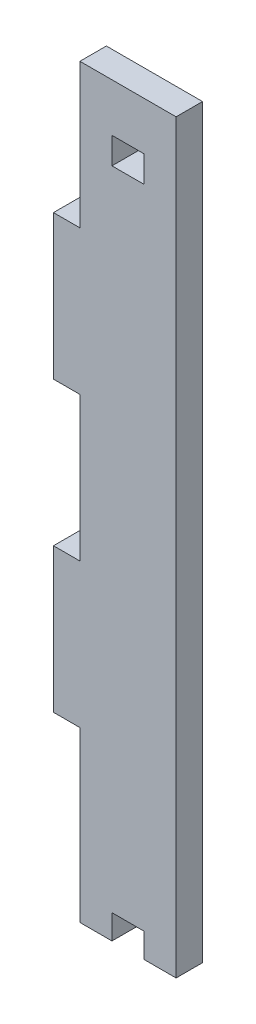
ISO-10303-21;
HEADER;
FILE_DESCRIPTION(('STEP AP214'),'2;1');
FILE_NAME('part.step','',(''),(''),'','','');
FILE_SCHEMA(('AUTOMOTIVE_DESIGN { 1 0 10303 214 1 1 1 1 }'));
ENDSEC;
DATA;
#1=APPLICATION_CONTEXT('core data for automotive mechanical design processes');
#2=APPLICATION_PROTOCOL_DEFINITION('international standard','automotive_design',2000,#1);
#3=PRODUCT_CONTEXT('',#1,'mechanical');
#4=PRODUCT('Part','Part','',(#3));
#5=PRODUCT_RELATED_PRODUCT_CATEGORY('part','',(#4));
#6=PRODUCT_DEFINITION_FORMATION('','',#4);
#7=PRODUCT_DEFINITION_CONTEXT('part definition',#1,'design');
#8=PRODUCT_DEFINITION('design','',#6,#7);
#9=PRODUCT_DEFINITION_SHAPE('','',#8);
#10=(LENGTH_UNIT() NAMED_UNIT(*) SI_UNIT(.MILLI.,.METRE.));
#11=(NAMED_UNIT(*) PLANE_ANGLE_UNIT() SI_UNIT($,.RADIAN.));
#12=(NAMED_UNIT(*) SI_UNIT($,.STERADIAN.) SOLID_ANGLE_UNIT());
#13=UNCERTAINTY_MEASURE_WITH_UNIT(LENGTH_MEASURE(1.E-05),#10,'distance_accuracy_value','');
#14=(GEOMETRIC_REPRESENTATION_CONTEXT(3) GLOBAL_UNCERTAINTY_ASSIGNED_CONTEXT((#13)) GLOBAL_UNIT_ASSIGNED_CONTEXT((#10,
#11,#12)) REPRESENTATION_CONTEXT('',''));
#15=CARTESIAN_POINT('',(0.,0.,0.));
#16=DIRECTION('',(0.,0.,1.));
#17=DIRECTION('',(1.,0.,0.));
#18=AXIS2_PLACEMENT_3D('',#15,#16,#17);
#19=CARTESIAN_POINT('',(0.,0.,5.5));
#20=DIRECTION('',(0.,1.,0.));
#21=DIRECTION('',(0.,0.,1.));
#22=AXIS2_PLACEMENT_3D('',#19,#20,#21);
#23=PLANE('',#22);
#24=DIRECTION('',(1.,0.,0.));
#25=VECTOR('',#24,1.);
#26=CARTESIAN_POINT('',(0.,0.,0.));
#27=LINE('',#26,#25);
#28=CARTESIAN_POINT('',(6.66666666666667,0.,0.));
#29=VERTEX_POINT('',#28);
#30=CARTESIAN_POINT('',(13.3333333333333,0.,0.));
#31=VERTEX_POINT('',#30);
#32=EDGE_CURVE('E53',#29,#31,#27,.T.);
#33=ORIENTED_EDGE('',*,*,#32,.T.);
#34=DIRECTION('',(0.,0.,1.));
#35=VECTOR('',#34,1.);
#36=CARTESIAN_POINT('',(13.3333333333333,0.,-8.39371457963901));
#37=LINE('',#36,#35);
#38=CARTESIAN_POINT('',(13.3333333333333,0.,5.5));
#39=VERTEX_POINT('',#38);
#40=EDGE_CURVE('E48',#31,#39,#37,.T.);
#41=ORIENTED_EDGE('',*,*,#40,.T.);
#42=DIRECTION('',(1.,0.,0.));
#43=VECTOR('',#42,1.);
#44=CARTESIAN_POINT('',(0.,0.,5.5));
#45=LINE('',#44,#43);
#46=CARTESIAN_POINT('',(6.66666666666667,0.,5.5));
#47=VERTEX_POINT('',#46);
#48=EDGE_CURVE('E185',#47,#39,#45,.T.);
#49=ORIENTED_EDGE('',*,*,#48,.F.);
#50=DIRECTION('',(0.,0.,1.));
#51=VECTOR('',#50,1.);
#52=CARTESIAN_POINT('',(6.66666666666667,0.,-8.39371457963901));
#53=LINE('',#52,#51);
#54=EDGE_CURVE('E205',#29,#47,#53,.T.);
#55=ORIENTED_EDGE('',*,*,#54,.F.);
#56=EDGE_LOOP('',(#33,#41,#49,#55));
#57=FACE_BOUND('',#56,.T.);
#58=ADVANCED_FACE('F31',(#57),#23,.F.);
#59=CARTESIAN_POINT('',(0.,0.,5.5));
#60=DIRECTION('',(1.,0.,0.));
#61=DIRECTION('',(0.,0.,-1.));
#62=AXIS2_PLACEMENT_3D('',#59,#60,#61);
#63=PLANE('',#62);
#64=DIRECTION('',(0.,-1.,0.));
#65=VECTOR('',#64,1.);
#66=CARTESIAN_POINT('',(0.,0.,0.));
#67=LINE('',#66,#65);
#68=CARTESIAN_POINT('',(0.,30.,0.));
#69=VERTEX_POINT('',#68);
#70=CARTESIAN_POINT('',(0.,-5.1,0.));
#71=VERTEX_POINT('',#70);
#72=EDGE_CURVE('E251',#69,#71,#67,.T.);
#73=ORIENTED_EDGE('',*,*,#72,.T.);
#74=DIRECTION('',(0.,0.,1.));
#75=VECTOR('',#74,1.);
#76=CARTESIAN_POINT('',(0.,-5.1,-8.39371457963901));
#77=LINE('',#76,#75);
#78=CARTESIAN_POINT('',(0.,-5.1,5.5));
#79=VERTEX_POINT('',#78);
#80=EDGE_CURVE('E213',#71,#79,#77,.T.);
#81=ORIENTED_EDGE('',*,*,#80,.T.);
#82=DIRECTION('',(0.,-1.,0.));
#83=VECTOR('',#82,1.);
#84=CARTESIAN_POINT('',(0.,0.,5.5));
#85=LINE('',#84,#83);
#86=CARTESIAN_POINT('',(0.,30.,5.5));
#87=VERTEX_POINT('',#86);
#88=EDGE_CURVE('E252',#87,#79,#85,.T.);
#89=ORIENTED_EDGE('',*,*,#88,.F.);
#90=DIRECTION('',(0.,0.,-1.));
#91=VECTOR('',#90,1.);
#92=CARTESIAN_POINT('',(0.,30.,5.5));
#93=LINE('',#92,#91);
#94=EDGE_CURVE('E276',#87,#69,#93,.T.);
#95=ORIENTED_EDGE('',*,*,#94,.T.);
#96=EDGE_LOOP('',(#73,#81,#89,#95));
#97=FACE_BOUND('',#96,.T.);
#98=ADVANCED_FACE('F33',(#97),#63,.F.);
#99=CARTESIAN_POINT('',(20.,0.,5.5));
#100=DIRECTION('',(-1.,0.,0.));
#101=DIRECTION('',(0.,-1.,0.));
#102=AXIS2_PLACEMENT_3D('',#99,#100,#101);
#103=PLANE('',#102);
#104=DIRECTION('',(0.,1.,0.));
#105=VECTOR('',#104,1.);
#106=CARTESIAN_POINT('',(20.,0.,0.));
#107=LINE('',#106,#105);
#108=CARTESIAN_POINT('',(20.,-5.1,0.));
#109=VERTEX_POINT('',#108);
#110=CARTESIAN_POINT('',(20.,150.,0.));
#111=VERTEX_POINT('',#110);
#112=EDGE_CURVE('E280',#109,#111,#107,.T.);
#113=ORIENTED_EDGE('',*,*,#112,.T.);
#114=DIRECTION('',(0.,0.,-1.));
#115=VECTOR('',#114,1.);
#116=CARTESIAN_POINT('',(20.,150.,5.5));
#117=LINE('',#116,#115);
#118=CARTESIAN_POINT('',(20.,150.,5.5));
#119=VERTEX_POINT('',#118);
#120=EDGE_CURVE('E284',#119,#111,#117,.T.);
#121=ORIENTED_EDGE('',*,*,#120,.F.);
#122=DIRECTION('',(0.,1.,0.));
#123=VECTOR('',#122,1.);
#124=CARTESIAN_POINT('',(20.,0.,5.5));
#125=LINE('',#124,#123);
#126=CARTESIAN_POINT('',(20.,-5.1,5.5));
#127=VERTEX_POINT('',#126);
#128=EDGE_CURVE('E256',#127,#119,#125,.T.);
#129=ORIENTED_EDGE('',*,*,#128,.F.);
#130=DIRECTION('',(0.,0.,1.));
#131=VECTOR('',#130,1.);
#132=CARTESIAN_POINT('',(20.,-5.1,-8.39371457963901));
#133=LINE('',#132,#131);
#134=EDGE_CURVE('E178',#109,#127,#133,.T.);
#135=ORIENTED_EDGE('',*,*,#134,.F.);
#136=EDGE_LOOP('',(#113,#121,#129,#135));
#137=FACE_BOUND('',#136,.T.);
#138=ADVANCED_FACE('F333',(#137),#103,.F.);
#139=CARTESIAN_POINT('',(0.,150.,5.5));
#140=DIRECTION('',(0.,-1.,0.));
#141=DIRECTION('',(0.,0.,-1.));
#142=AXIS2_PLACEMENT_3D('',#139,#140,#141);
#143=PLANE('',#142);
#144=DIRECTION('',(-1.,0.,0.));
#145=VECTOR('',#144,1.);
#146=CARTESIAN_POINT('',(0.,150.,0.));
#147=LINE('',#146,#145);
#148=CARTESIAN_POINT('',(0.,150.,0.));
#149=VERTEX_POINT('',#148);
#150=EDGE_CURVE('E327',#111,#149,#147,.T.);
#151=ORIENTED_EDGE('',*,*,#150,.T.);
#152=DIRECTION('',(0.,0.,-1.));
#153=VECTOR('',#152,1.);
#154=CARTESIAN_POINT('',(0.,150.,5.5));
#155=LINE('',#154,#153);
#156=CARTESIAN_POINT('',(0.,150.,5.5));
#157=VERTEX_POINT('',#156);
#158=EDGE_CURVE('E287',#157,#149,#155,.T.);
#159=ORIENTED_EDGE('',*,*,#158,.F.);
#160=DIRECTION('',(-1.,0.,0.));
#161=VECTOR('',#160,1.);
#162=CARTESIAN_POINT('',(0.,150.,5.5));
#163=LINE('',#162,#161);
#164=EDGE_CURVE('E258',#119,#157,#163,.T.);
#165=ORIENTED_EDGE('',*,*,#164,.F.);
#166=ORIENTED_EDGE('',*,*,#120,.T.);
#167=EDGE_LOOP('',(#151,#159,#165,#166));
#168=FACE_BOUND('',#167,.T.);
#169=ADVANCED_FACE('F335',(#168),#143,.F.);
#170=CARTESIAN_POINT('',(0.,120.,5.5));
#171=DIRECTION('',(1.,0.,0.));
#172=DIRECTION('',(0.,0.,-1.));
#173=AXIS2_PLACEMENT_3D('',#170,#171,#172);
#174=PLANE('',#173);
#175=DIRECTION('',(0.,-1.,0.));
#176=VECTOR('',#175,1.);
#177=CARTESIAN_POINT('',(0.,120.,0.));
#178=LINE('',#177,#176);
#179=CARTESIAN_POINT('',(0.,120.,0.));
#180=VERTEX_POINT('',#179);
#181=EDGE_CURVE('E326',#149,#180,#178,.T.);
#182=ORIENTED_EDGE('',*,*,#181,.T.);
#183=DIRECTION('',(0.,0.,-1.));
#184=VECTOR('',#183,1.);
#185=CARTESIAN_POINT('',(0.,120.,5.5));
#186=LINE('',#185,#184);
#187=CARTESIAN_POINT('',(0.,120.,5.5));
#188=VERTEX_POINT('',#187);
#189=EDGE_CURVE('E290',#188,#180,#186,.T.);
#190=ORIENTED_EDGE('',*,*,#189,.F.);
#191=DIRECTION('',(0.,-1.,0.));
#192=VECTOR('',#191,1.);
#193=CARTESIAN_POINT('',(0.,120.,5.5));
#194=LINE('',#193,#192);
#195=EDGE_CURVE('E260',#157,#188,#194,.T.);
#196=ORIENTED_EDGE('',*,*,#195,.F.);
#197=ORIENTED_EDGE('',*,*,#158,.T.);
#198=EDGE_LOOP('',(#182,#190,#196,#197));
#199=FACE_BOUND('',#198,.T.);
#200=ADVANCED_FACE('F342',(#199),#174,.F.);
#201=CARTESIAN_POINT('',(0.,120.,5.5));
#202=DIRECTION('',(0.,-1.,0.));
#203=DIRECTION('',(1.,0.,0.));
#204=AXIS2_PLACEMENT_3D('',#201,#202,#203);
#205=PLANE('',#204);
#206=DIRECTION('',(-1.,0.,0.));
#207=VECTOR('',#206,1.);
#208=CARTESIAN_POINT('',(0.,120.,0.));
#209=LINE('',#208,#207);
#210=CARTESIAN_POINT('',(-5.5,120.,0.));
#211=VERTEX_POINT('',#210);
#212=EDGE_CURVE('E324',#180,#211,#209,.T.);
#213=ORIENTED_EDGE('',*,*,#212,.T.);
#214=DIRECTION('',(0.,0.,-1.));
#215=VECTOR('',#214,1.);
#216=CARTESIAN_POINT('',(-5.5,120.,5.5));
#217=LINE('',#216,#215);
#218=CARTESIAN_POINT('',(-5.5,120.,5.5));
#219=VERTEX_POINT('',#218);
#220=EDGE_CURVE('E293',#219,#211,#217,.T.);
#221=ORIENTED_EDGE('',*,*,#220,.F.);
#222=DIRECTION('',(-1.,0.,0.));
#223=VECTOR('',#222,1.);
#224=CARTESIAN_POINT('',(0.,120.,5.5));
#225=LINE('',#224,#223);
#226=EDGE_CURVE('E262',#188,#219,#225,.T.);
#227=ORIENTED_EDGE('',*,*,#226,.F.);
#228=ORIENTED_EDGE('',*,*,#189,.T.);
#229=EDGE_LOOP('',(#213,#221,#227,#228));
#230=FACE_BOUND('',#229,.T.);
#231=ADVANCED_FACE('F346',(#230),#205,.F.);
#232=CARTESIAN_POINT('',(-5.5,120.,5.5));
#233=DIRECTION('',(1.,0.,0.));
#234=DIRECTION('',(0.,0.,-1.));
#235=AXIS2_PLACEMENT_3D('',#232,#233,#234);
#236=PLANE('',#235);
#237=DIRECTION('',(0.,-1.,0.));
#238=VECTOR('',#237,1.);
#239=CARTESIAN_POINT('',(-5.5,120.,0.));
#240=LINE('',#239,#238);
#241=CARTESIAN_POINT('',(-5.5,90.,0.));
#242=VERTEX_POINT('',#241);
#243=EDGE_CURVE('E322',#211,#242,#240,.T.);
#244=ORIENTED_EDGE('',*,*,#243,.T.);
#245=DIRECTION('',(0.,0.,-1.));
#246=VECTOR('',#245,1.);
#247=CARTESIAN_POINT('',(-5.5,90.,5.5));
#248=LINE('',#247,#246);
#249=CARTESIAN_POINT('',(-5.5,90.,5.5));
#250=VERTEX_POINT('',#249);
#251=EDGE_CURVE('E296',#250,#242,#248,.T.);
#252=ORIENTED_EDGE('',*,*,#251,.F.);
#253=DIRECTION('',(0.,-1.,0.));
#254=VECTOR('',#253,1.);
#255=CARTESIAN_POINT('',(-5.5,120.,5.5));
#256=LINE('',#255,#254);
#257=EDGE_CURVE('E264',#219,#250,#256,.T.);
#258=ORIENTED_EDGE('',*,*,#257,.F.);
#259=ORIENTED_EDGE('',*,*,#220,.T.);
#260=EDGE_LOOP('',(#244,#252,#258,#259));
#261=FACE_BOUND('',#260,.T.);
#262=ADVANCED_FACE('F353',(#261),#236,.F.);
#263=CARTESIAN_POINT('',(0.,90.,5.5));
#264=DIRECTION('',(0.,1.,0.));
#265=DIRECTION('',(-1.,0.,0.));
#266=AXIS2_PLACEMENT_3D('',#263,#264,#265);
#267=PLANE('',#266);
#268=DIRECTION('',(1.,0.,0.));
#269=VECTOR('',#268,1.);
#270=CARTESIAN_POINT('',(0.,90.,0.));
#271=LINE('',#270,#269);
#272=CARTESIAN_POINT('',(0.,90.,0.));
#273=VERTEX_POINT('',#272);
#274=EDGE_CURVE('E320',#242,#273,#271,.T.);
#275=ORIENTED_EDGE('',*,*,#274,.T.);
#276=DIRECTION('',(0.,0.,-1.));
#277=VECTOR('',#276,1.);
#278=CARTESIAN_POINT('',(0.,90.,5.5));
#279=LINE('',#278,#277);
#280=CARTESIAN_POINT('',(0.,90.,5.5));
#281=VERTEX_POINT('',#280);
#282=EDGE_CURVE('E299',#281,#273,#279,.T.);
#283=ORIENTED_EDGE('',*,*,#282,.F.);
#284=DIRECTION('',(1.,0.,0.));
#285=VECTOR('',#284,1.);
#286=CARTESIAN_POINT('',(0.,90.,5.5));
#287=LINE('',#286,#285);
#288=EDGE_CURVE('E266',#250,#281,#287,.T.);
#289=ORIENTED_EDGE('',*,*,#288,.F.);
#290=ORIENTED_EDGE('',*,*,#251,.T.);
#291=EDGE_LOOP('',(#275,#283,#289,#290));
#292=FACE_BOUND('',#291,.T.);
#293=ADVANCED_FACE('F356',(#292),#267,.F.);
#294=CARTESIAN_POINT('',(0.,60.,5.5));
#295=DIRECTION('',(1.,0.,0.));
#296=DIRECTION('',(0.,0.,-1.));
#297=AXIS2_PLACEMENT_3D('',#294,#295,#296);
#298=PLANE('',#297);
#299=DIRECTION('',(0.,-1.,0.));
#300=VECTOR('',#299,1.);
#301=CARTESIAN_POINT('',(0.,60.,0.));
#302=LINE('',#301,#300);
#303=CARTESIAN_POINT('',(0.,60.,0.));
#304=VERTEX_POINT('',#303);
#305=EDGE_CURVE('E318',#273,#304,#302,.T.);
#306=ORIENTED_EDGE('',*,*,#305,.T.);
#307=DIRECTION('',(0.,0.,-1.));
#308=VECTOR('',#307,1.);
#309=CARTESIAN_POINT('',(0.,60.,5.5));
#310=LINE('',#309,#308);
#311=CARTESIAN_POINT('',(0.,60.,5.5));
#312=VERTEX_POINT('',#311);
#313=EDGE_CURVE('E302',#312,#304,#310,.T.);
#314=ORIENTED_EDGE('',*,*,#313,.F.);
#315=DIRECTION('',(0.,-1.,0.));
#316=VECTOR('',#315,1.);
#317=CARTESIAN_POINT('',(0.,60.,5.5));
#318=LINE('',#317,#316);
#319=EDGE_CURVE('E268',#281,#312,#318,.T.);
#320=ORIENTED_EDGE('',*,*,#319,.F.);
#321=ORIENTED_EDGE('',*,*,#282,.T.);
#322=EDGE_LOOP('',(#306,#314,#320,#321));
#323=FACE_BOUND('',#322,.T.);
#324=ADVANCED_FACE('F361',(#323),#298,.F.);
#325=CARTESIAN_POINT('',(0.,60.,5.5));
#326=DIRECTION('',(0.,-1.,0.));
#327=DIRECTION('',(1.,0.,0.));
#328=AXIS2_PLACEMENT_3D('',#325,#326,#327);
#329=PLANE('',#328);
#330=DIRECTION('',(-1.,0.,0.));
#331=VECTOR('',#330,1.);
#332=CARTESIAN_POINT('',(0.,60.,0.));
#333=LINE('',#332,#331);
#334=CARTESIAN_POINT('',(-5.5,60.,0.));
#335=VERTEX_POINT('',#334);
#336=EDGE_CURVE('E316',#304,#335,#333,.T.);
#337=ORIENTED_EDGE('',*,*,#336,.T.);
#338=DIRECTION('',(0.,0.,-1.));
#339=VECTOR('',#338,1.);
#340=CARTESIAN_POINT('',(-5.5,60.,5.5));
#341=LINE('',#340,#339);
#342=CARTESIAN_POINT('',(-5.5,60.,5.5));
#343=VERTEX_POINT('',#342);
#344=EDGE_CURVE('E305',#343,#335,#341,.T.);
#345=ORIENTED_EDGE('',*,*,#344,.F.);
#346=DIRECTION('',(-1.,0.,0.));
#347=VECTOR('',#346,1.);
#348=CARTESIAN_POINT('',(0.,60.,5.5));
#349=LINE('',#348,#347);
#350=EDGE_CURVE('E270',#312,#343,#349,.T.);
#351=ORIENTED_EDGE('',*,*,#350,.F.);
#352=ORIENTED_EDGE('',*,*,#313,.T.);
#353=EDGE_LOOP('',(#337,#345,#351,#352));
#354=FACE_BOUND('',#353,.T.);
#355=ADVANCED_FACE('F367',(#354),#329,.F.);
#356=CARTESIAN_POINT('',(-5.5,60.,5.5));
#357=DIRECTION('',(1.,0.,0.));
#358=DIRECTION('',(0.,0.,-1.));
#359=AXIS2_PLACEMENT_3D('',#356,#357,#358);
#360=PLANE('',#359);
#361=DIRECTION('',(0.,-1.,0.));
#362=VECTOR('',#361,1.);
#363=CARTESIAN_POINT('',(-5.5,60.,0.));
#364=LINE('',#363,#362);
#365=CARTESIAN_POINT('',(-5.5,30.,0.));
#366=VERTEX_POINT('',#365);
#367=EDGE_CURVE('E314',#335,#366,#364,.T.);
#368=ORIENTED_EDGE('',*,*,#367,.T.);
#369=DIRECTION('',(0.,0.,-1.));
#370=VECTOR('',#369,1.);
#371=CARTESIAN_POINT('',(-5.5,30.,5.5));
#372=LINE('',#371,#370);
#373=CARTESIAN_POINT('',(-5.5,30.,5.5));
#374=VERTEX_POINT('',#373);
#375=EDGE_CURVE('E308',#374,#366,#372,.T.);
#376=ORIENTED_EDGE('',*,*,#375,.F.);
#377=DIRECTION('',(0.,-1.,0.));
#378=VECTOR('',#377,1.);
#379=CARTESIAN_POINT('',(-5.5,60.,5.5));
#380=LINE('',#379,#378);
#381=EDGE_CURVE('E272',#343,#374,#380,.T.);
#382=ORIENTED_EDGE('',*,*,#381,.F.);
#383=ORIENTED_EDGE('',*,*,#344,.T.);
#384=EDGE_LOOP('',(#368,#376,#382,#383));
#385=FACE_BOUND('',#384,.T.);
#386=ADVANCED_FACE('F371',(#385),#360,.F.);
#387=CARTESIAN_POINT('',(0.,30.,5.5));
#388=DIRECTION('',(0.,1.,0.));
#389=DIRECTION('',(0.,0.,1.));
#390=AXIS2_PLACEMENT_3D('',#387,#388,#389);
#391=PLANE('',#390);
#392=DIRECTION('',(1.,0.,0.));
#393=VECTOR('',#392,1.);
#394=CARTESIAN_POINT('',(0.,30.,0.));
#395=LINE('',#394,#393);
#396=EDGE_CURVE('E253',#366,#69,#395,.T.);
#397=ORIENTED_EDGE('',*,*,#396,.T.);
#398=ORIENTED_EDGE('',*,*,#94,.F.);
#399=DIRECTION('',(1.,0.,0.));
#400=VECTOR('',#399,1.);
#401=CARTESIAN_POINT('',(0.,30.,5.5));
#402=LINE('',#401,#400);
#403=EDGE_CURVE('E274',#374,#87,#402,.T.);
#404=ORIENTED_EDGE('',*,*,#403,.F.);
#405=ORIENTED_EDGE('',*,*,#375,.T.);
#406=EDGE_LOOP('',(#397,#398,#404,#405));
#407=FACE_BOUND('',#406,.T.);
#408=ADVANCED_FACE('F376',(#407),#391,.F.);
#409=CARTESIAN_POINT('',(0.,30.,5.5));
#410=DIRECTION('',(0.,0.,1.));
#411=DIRECTION('',(1.,0.,0.));
#412=AXIS2_PLACEMENT_3D('',#409,#410,#411);
#413=PLANE('',#412);
#414=DIRECTION('',(-1.,0.,0.));
#415=VECTOR('',#414,1.);
#416=CARTESIAN_POINT('',(13.3333333333333,134.5,5.49999999999997));
#417=LINE('',#416,#415);
#418=CARTESIAN_POINT('',(13.3333333333333,134.5,5.49999999999997));
#419=VERTEX_POINT('',#418);
#420=CARTESIAN_POINT('',(6.66666666666664,134.5,5.49999999999997));
#421=VERTEX_POINT('',#420);
#422=EDGE_CURVE('E231',#419,#421,#417,.T.);
#423=ORIENTED_EDGE('',*,*,#422,.T.);
#424=DIRECTION('',(0.,1.,0.));
#425=VECTOR('',#424,1.);
#426=CARTESIAN_POINT('',(6.66666666666664,134.5,5.49999999999997));
#427=LINE('',#426,#425);
#428=CARTESIAN_POINT('',(6.66666666666664,140.,5.49999999999997));
#429=VERTEX_POINT('',#428);
#430=EDGE_CURVE('E243',#421,#429,#427,.T.);
#431=ORIENTED_EDGE('',*,*,#430,.T.);
#432=DIRECTION('',(-1.,0.,0.));
#433=VECTOR('',#432,1.);
#434=CARTESIAN_POINT('',(13.3333333333333,140.,5.49999999999997));
#435=LINE('',#434,#433);
#436=CARTESIAN_POINT('',(13.3333333333333,140.,5.5));
#437=VERTEX_POINT('',#436);
#438=EDGE_CURVE('E226',#437,#429,#435,.T.);
#439=ORIENTED_EDGE('',*,*,#438,.F.);
#440=DIRECTION('',(0.,1.,0.));
#441=VECTOR('',#440,1.);
#442=CARTESIAN_POINT('',(13.3333333333333,134.5,5.49999999999997));
#443=LINE('',#442,#441);
#444=EDGE_CURVE('E246',#419,#437,#443,.T.);
#445=ORIENTED_EDGE('',*,*,#444,.F.);
#446=EDGE_LOOP('',(#423,#431,#439,#445));
#447=FACE_BOUND('',#446,.T.);
#448=ORIENTED_EDGE('',*,*,#88,.T.);
#449=DIRECTION('',(1.,0.,0.));
#450=VECTOR('',#449,1.);
#451=CARTESIAN_POINT('',(0.,-5.1,5.5));
#452=LINE('',#451,#450);
#453=CARTESIAN_POINT('',(6.66666666666667,-5.1,5.5));
#454=VERTEX_POINT('',#453);
#455=EDGE_CURVE('E195',#79,#454,#452,.T.);
#456=ORIENTED_EDGE('',*,*,#455,.T.);
#457=DIRECTION('',(0.,1.,0.));
#458=VECTOR('',#457,1.);
#459=CARTESIAN_POINT('',(6.66666666666667,0.,5.5));
#460=LINE('',#459,#458);
#461=EDGE_CURVE('E198',#454,#47,#460,.T.);
#462=ORIENTED_EDGE('',*,*,#461,.T.);
#463=ORIENTED_EDGE('',*,*,#48,.T.);
#464=DIRECTION('',(0.,-1.,0.));
#465=VECTOR('',#464,1.);
#466=CARTESIAN_POINT('',(13.3333333333333,0.,5.5));
#467=LINE('',#466,#465);
#468=CARTESIAN_POINT('',(13.3333333333333,-5.1,5.5));
#469=VERTEX_POINT('',#468);
#470=EDGE_CURVE('E173',#39,#469,#467,.T.);
#471=ORIENTED_EDGE('',*,*,#470,.T.);
#472=DIRECTION('',(1.,0.,0.));
#473=VECTOR('',#472,1.);
#474=CARTESIAN_POINT('',(20.,-5.1,5.5));
#475=LINE('',#474,#473);
#476=EDGE_CURVE('E183',#469,#127,#475,.T.);
#477=ORIENTED_EDGE('',*,*,#476,.T.);
#478=ORIENTED_EDGE('',*,*,#128,.T.);
#479=ORIENTED_EDGE('',*,*,#164,.T.);
#480=ORIENTED_EDGE('',*,*,#195,.T.);
#481=ORIENTED_EDGE('',*,*,#226,.T.);
#482=ORIENTED_EDGE('',*,*,#257,.T.);
#483=ORIENTED_EDGE('',*,*,#288,.T.);
#484=ORIENTED_EDGE('',*,*,#319,.T.);
#485=ORIENTED_EDGE('',*,*,#350,.T.);
#486=ORIENTED_EDGE('',*,*,#381,.T.);
#487=ORIENTED_EDGE('',*,*,#403,.T.);
#488=EDGE_LOOP('',(#448,#456,#462,#463,#471,#477,#478,#479,#480,#481,#482,#483,#484,#485,#486,#487));
#489=FACE_BOUND('',#488,.T.);
#490=ADVANCED_FACE('F182',(#447,#489),#413,.T.);
#491=CARTESIAN_POINT('',(0.,30.,0.));
#492=DIRECTION('',(0.,0.,1.));
#493=DIRECTION('',(1.,0.,0.));
#494=AXIS2_PLACEMENT_3D('',#491,#492,#493);
#495=PLANE('',#494);
#496=DIRECTION('',(0.,1.,0.));
#497=VECTOR('',#496,1.);
#498=CARTESIAN_POINT('',(6.66666666666664,134.5,0.));
#499=LINE('',#498,#497);
#500=CARTESIAN_POINT('',(6.66666666666664,134.5,0.));
#501=VERTEX_POINT('',#500);
#502=CARTESIAN_POINT('',(6.66666666666664,140.,0.));
#503=VERTEX_POINT('',#502);
#504=EDGE_CURVE('E237',#501,#503,#499,.T.);
#505=ORIENTED_EDGE('',*,*,#504,.F.);
#506=DIRECTION('',(1.,0.,0.));
#507=VECTOR('',#506,1.);
#508=CARTESIAN_POINT('',(0.,134.5,0.));
#509=LINE('',#508,#507);
#510=CARTESIAN_POINT('',(13.3333333333333,134.5,0.));
#511=VERTEX_POINT('',#510);
#512=EDGE_CURVE('E11',#501,#511,#509,.T.);
#513=ORIENTED_EDGE('',*,*,#512,.T.);
#514=DIRECTION('',(0.,1.,0.));
#515=VECTOR('',#514,1.);
#516=CARTESIAN_POINT('',(13.3333333333333,134.5,0.));
#517=LINE('',#516,#515);
#518=CARTESIAN_POINT('',(13.3333333333333,140.,0.));
#519=VERTEX_POINT('',#518);
#520=EDGE_CURVE('E248',#511,#519,#517,.T.);
#521=ORIENTED_EDGE('',*,*,#520,.T.);
#522=DIRECTION('',(1.,0.,0.));
#523=VECTOR('',#522,1.);
#524=CARTESIAN_POINT('',(0.,140.,0.));
#525=LINE('',#524,#523);
#526=EDGE_CURVE('E40',#503,#519,#525,.T.);
#527=ORIENTED_EDGE('',*,*,#526,.F.);
#528=EDGE_LOOP('',(#505,#513,#521,#527));
#529=FACE_BOUND('',#528,.T.);
#530=ORIENTED_EDGE('',*,*,#212,.F.);
#531=ORIENTED_EDGE('',*,*,#181,.F.);
#532=ORIENTED_EDGE('',*,*,#150,.F.);
#533=ORIENTED_EDGE('',*,*,#112,.F.);
#534=DIRECTION('',(-1.,0.,0.));
#535=VECTOR('',#534,1.);
#536=CARTESIAN_POINT('',(20.,-5.1,0.));
#537=LINE('',#536,#535);
#538=CARTESIAN_POINT('',(13.3333333333333,-5.1,0.));
#539=VERTEX_POINT('',#538);
#540=EDGE_CURVE('E199',#109,#539,#537,.T.);
#541=ORIENTED_EDGE('',*,*,#540,.T.);
#542=DIRECTION('',(0.,1.,0.));
#543=VECTOR('',#542,1.);
#544=CARTESIAN_POINT('',(13.3333333333333,0.,0.));
#545=LINE('',#544,#543);
#546=EDGE_CURVE('E174',#539,#31,#545,.T.);
#547=ORIENTED_EDGE('',*,*,#546,.T.);
#548=ORIENTED_EDGE('',*,*,#32,.F.);
#549=DIRECTION('',(0.,-1.,0.));
#550=VECTOR('',#549,1.);
#551=CARTESIAN_POINT('',(6.66666666666667,0.,0.));
#552=LINE('',#551,#550);
#553=CARTESIAN_POINT('',(6.66666666666667,-5.1,0.));
#554=VERTEX_POINT('',#553);
#555=EDGE_CURVE('E209',#29,#554,#552,.T.);
#556=ORIENTED_EDGE('',*,*,#555,.T.);
#557=DIRECTION('',(-1.,0.,0.));
#558=VECTOR('',#557,1.);
#559=CARTESIAN_POINT('',(0.,-5.1,0.));
#560=LINE('',#559,#558);
#561=EDGE_CURVE('E215',#554,#71,#560,.T.);
#562=ORIENTED_EDGE('',*,*,#561,.T.);
#563=ORIENTED_EDGE('',*,*,#72,.F.);
#564=ORIENTED_EDGE('',*,*,#396,.F.);
#565=ORIENTED_EDGE('',*,*,#367,.F.);
#566=ORIENTED_EDGE('',*,*,#336,.F.);
#567=ORIENTED_EDGE('',*,*,#305,.F.);
#568=ORIENTED_EDGE('',*,*,#274,.F.);
#569=ORIENTED_EDGE('',*,*,#243,.F.);
#570=EDGE_LOOP('',(#530,#531,#532,#533,#541,#547,#548,#556,#562,#563,#564,#565,#566,#567,#568,#569));
#571=FACE_BOUND('',#570,.T.);
#572=ADVANCED_FACE('F338',(#529,#571),#495,.F.);
#573=CARTESIAN_POINT('',(6.66666666666664,134.5,0.));
#574=DIRECTION('',(0.,-1.,0.));
#575=DIRECTION('',(0.,0.,-1.));
#576=AXIS2_PLACEMENT_3D('',#573,#574,#575);
#577=PLANE('',#576);
#578=DIRECTION('',(0.,0.,-1.));
#579=VECTOR('',#578,1.);
#580=CARTESIAN_POINT('',(6.66666666666664,134.5,0.));
#581=LINE('',#580,#579);
#582=EDGE_CURVE('E235',#421,#501,#581,.T.);
#583=ORIENTED_EDGE('',*,*,#582,.F.);
#584=ORIENTED_EDGE('',*,*,#422,.F.);
#585=DIRECTION('',(0.,0.,1.));
#586=VECTOR('',#585,1.);
#587=CARTESIAN_POINT('',(13.3333333333333,134.5,0.));
#588=LINE('',#587,#586);
#589=EDGE_CURVE('E229',#511,#419,#588,.T.);
#590=ORIENTED_EDGE('',*,*,#589,.F.);
#591=ORIENTED_EDGE('',*,*,#512,.F.);
#592=EDGE_LOOP('',(#583,#584,#590,#591));
#593=FACE_BOUND('',#592,.T.);
#594=ADVANCED_FACE('F414',(#593),#577,.F.);
#595=CARTESIAN_POINT('',(6.66666666666664,140.,0.));
#596=DIRECTION('',(0.,-1.,0.));
#597=DIRECTION('',(0.,0.,-1.));
#598=AXIS2_PLACEMENT_3D('',#595,#596,#597);
#599=PLANE('',#598);
#600=ORIENTED_EDGE('',*,*,#526,.T.);
#601=DIRECTION('',(0.,0.,1.));
#602=VECTOR('',#601,1.);
#603=CARTESIAN_POINT('',(13.3333333333333,140.,0.));
#604=LINE('',#603,#602);
#605=EDGE_CURVE('E220',#519,#437,#604,.T.);
#606=ORIENTED_EDGE('',*,*,#605,.T.);
#607=ORIENTED_EDGE('',*,*,#438,.T.);
#608=DIRECTION('',(0.,0.,-1.));
#609=VECTOR('',#608,1.);
#610=CARTESIAN_POINT('',(6.66666666666664,140.,0.));
#611=LINE('',#610,#609);
#612=EDGE_CURVE('E232',#429,#503,#611,.T.);
#613=ORIENTED_EDGE('',*,*,#612,.T.);
#614=EDGE_LOOP('',(#600,#606,#607,#613));
#615=FACE_BOUND('',#614,.T.);
#616=ADVANCED_FACE('F423',(#615),#599,.T.);
#617=CARTESIAN_POINT('',(13.3333333333333,134.5,0.));
#618=DIRECTION('',(-1.,0.,0.));
#619=DIRECTION('',(0.,1.,0.));
#620=AXIS2_PLACEMENT_3D('',#617,#618,#619);
#621=PLANE('',#620);
#622=ORIENTED_EDGE('',*,*,#605,.F.);
#623=ORIENTED_EDGE('',*,*,#520,.F.);
#624=ORIENTED_EDGE('',*,*,#589,.T.);
#625=ORIENTED_EDGE('',*,*,#444,.T.);
#626=EDGE_LOOP('',(#622,#623,#624,#625));
#627=FACE_BOUND('',#626,.T.);
#628=ADVANCED_FACE('F419',(#627),#621,.T.);
#629=CARTESIAN_POINT('',(6.66666666666664,134.5,0.));
#630=DIRECTION('',(1.,0.,0.));
#631=DIRECTION('',(0.,0.,1.));
#632=AXIS2_PLACEMENT_3D('',#629,#630,#631);
#633=PLANE('',#632);
#634=ORIENTED_EDGE('',*,*,#612,.F.);
#635=ORIENTED_EDGE('',*,*,#430,.F.);
#636=ORIENTED_EDGE('',*,*,#582,.T.);
#637=ORIENTED_EDGE('',*,*,#504,.T.);
#638=EDGE_LOOP('',(#634,#635,#636,#637));
#639=FACE_BOUND('',#638,.T.);
#640=ADVANCED_FACE('F422',(#639),#633,.T.);
#641=CARTESIAN_POINT('',(6.66666666666667,0.,-8.39371457963901));
#642=DIRECTION('',(1.,0.,0.));
#643=DIRECTION('',(0.,1.,0.));
#644=AXIS2_PLACEMENT_3D('',#641,#642,#643);
#645=PLANE('',#644);
#646=ORIENTED_EDGE('',*,*,#555,.F.);
#647=ORIENTED_EDGE('',*,*,#54,.T.);
#648=ORIENTED_EDGE('',*,*,#461,.F.);
#649=DIRECTION('',(0.,0.,1.));
#650=VECTOR('',#649,1.);
#651=CARTESIAN_POINT('',(6.66666666666667,-5.1,-8.39371457963901));
#652=LINE('',#651,#650);
#653=EDGE_CURVE('E202',#554,#454,#652,.T.);
#654=ORIENTED_EDGE('',*,*,#653,.F.);
#655=EDGE_LOOP('',(#646,#647,#648,#654));
#656=FACE_BOUND('',#655,.T.);
#657=ADVANCED_FACE('F385',(#656),#645,.T.);
#658=CARTESIAN_POINT('',(0.,-5.1,-8.39371457963901));
#659=DIRECTION('',(0.,-1.,0.));
#660=DIRECTION('',(0.,0.,-1.));
#661=AXIS2_PLACEMENT_3D('',#658,#659,#660);
#662=PLANE('',#661);
#663=ORIENTED_EDGE('',*,*,#561,.F.);
#664=ORIENTED_EDGE('',*,*,#653,.T.);
#665=ORIENTED_EDGE('',*,*,#455,.F.);
#666=ORIENTED_EDGE('',*,*,#80,.F.);
#667=EDGE_LOOP('',(#663,#664,#665,#666));
#668=FACE_BOUND('',#667,.T.);
#669=ADVANCED_FACE('F382',(#668),#662,.T.);
#670=CARTESIAN_POINT('',(20.,-5.1,-8.39371457963901));
#671=DIRECTION('',(0.,-1.,0.));
#672=DIRECTION('',(0.,0.,-1.));
#673=AXIS2_PLACEMENT_3D('',#670,#671,#672);
#674=PLANE('',#673);
#675=ORIENTED_EDGE('',*,*,#540,.F.);
#676=ORIENTED_EDGE('',*,*,#134,.T.);
#677=ORIENTED_EDGE('',*,*,#476,.F.);
#678=DIRECTION('',(0.,0.,1.));
#679=VECTOR('',#678,1.);
#680=CARTESIAN_POINT('',(13.3333333333333,-5.1,-8.39371457963901));
#681=LINE('',#680,#679);
#682=EDGE_CURVE('E170',#539,#469,#681,.T.);
#683=ORIENTED_EDGE('',*,*,#682,.F.);
#684=EDGE_LOOP('',(#675,#676,#677,#683));
#685=FACE_BOUND('',#684,.T.);
#686=ADVANCED_FACE('F188',(#685),#674,.T.);
#687=CARTESIAN_POINT('',(13.3333333333333,0.,-8.39371457963901));
#688=DIRECTION('',(-1.,0.,0.));
#689=DIRECTION('',(0.,0.,1.));
#690=AXIS2_PLACEMENT_3D('',#687,#688,#689);
#691=PLANE('',#690);
#692=ORIENTED_EDGE('',*,*,#546,.F.);
#693=ORIENTED_EDGE('',*,*,#682,.T.);
#694=ORIENTED_EDGE('',*,*,#470,.F.);
#695=ORIENTED_EDGE('',*,*,#40,.F.);
#696=EDGE_LOOP('',(#692,#693,#694,#695));
#697=FACE_BOUND('',#696,.T.);
#698=ADVANCED_FACE('F172',(#697),#691,.T.);
#699=CLOSED_SHELL('',(#58,#98,#138,#169,#200,#231,#262,#293,#324,#355,#386,#408,#490,#572,#594,
#616,#628,#640,#657,#669,#686,#698));
#700=MANIFOLD_SOLID_BREP('B2',#699);
#701=ADVANCED_BREP_SHAPE_REPRESENTATION('',(#18,#700),#14);
#702=SHAPE_DEFINITION_REPRESENTATION(#9,#701);
ENDSEC;
END-ISO-10303-21;
